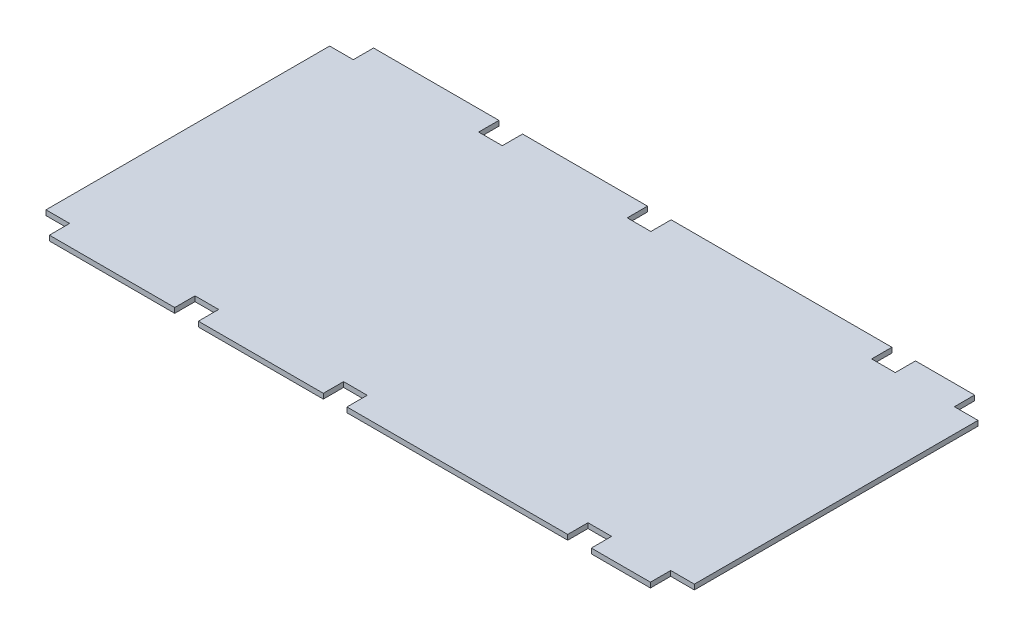
ISO-10303-21;
HEADER;
FILE_DESCRIPTION(('STEP AP214'),'2;1');
FILE_NAME('part.step','',(''),(''),'','','');
FILE_SCHEMA(('AUTOMOTIVE_DESIGN { 1 0 10303 214 1 1 1 1 }'));
ENDSEC;
DATA;
#1=APPLICATION_CONTEXT('core data for automotive mechanical design processes');
#2=APPLICATION_PROTOCOL_DEFINITION('international standard','automotive_design',2000,#1);
#3=PRODUCT_CONTEXT('',#1,'mechanical');
#4=PRODUCT('Part','Part','',(#3));
#5=PRODUCT_RELATED_PRODUCT_CATEGORY('part','',(#4));
#6=PRODUCT_DEFINITION_FORMATION('','',#4);
#7=PRODUCT_DEFINITION_CONTEXT('part definition',#1,'design');
#8=PRODUCT_DEFINITION('design','',#6,#7);
#9=PRODUCT_DEFINITION_SHAPE('','',#8);
#10=(LENGTH_UNIT() NAMED_UNIT(*) SI_UNIT(.MILLI.,.METRE.));
#11=(NAMED_UNIT(*) PLANE_ANGLE_UNIT() SI_UNIT($,.RADIAN.));
#12=(NAMED_UNIT(*) SI_UNIT($,.STERADIAN.) SOLID_ANGLE_UNIT());
#13=UNCERTAINTY_MEASURE_WITH_UNIT(LENGTH_MEASURE(1.E-05),#10,'distance_accuracy_value','');
#14=(GEOMETRIC_REPRESENTATION_CONTEXT(3) GLOBAL_UNCERTAINTY_ASSIGNED_CONTEXT((#13)) GLOBAL_UNIT_ASSIGNED_CONTEXT((#10,
#11,#12)) REPRESENTATION_CONTEXT('',''));
#15=CARTESIAN_POINT('',(0.,0.,0.));
#16=DIRECTION('',(0.,0.,1.));
#17=DIRECTION('',(1.,0.,0.));
#18=AXIS2_PLACEMENT_3D('',#15,#16,#17);
#19=CARTESIAN_POINT('',(0.,9.525,0.));
#20=DIRECTION('',(0.,0.,-1.));
#21=DIRECTION('',(-1.,0.,0.));
#22=AXIS2_PLACEMENT_3D('',#19,#20,#21);
#23=PLANE('',#22);
#24=DIRECTION('',(1.,0.,0.));
#25=VECTOR('',#24,1.);
#26=CARTESIAN_POINT('',(0.,-9.525,0.));
#27=LINE('',#26,#25);
#28=CARTESIAN_POINT('',(1208.0875,-9.525,2.22044604925031E-13));
#29=VERTEX_POINT('',#28);
#30=CARTESIAN_POINT('',(2038.35,-9.525,2.22044604925031E-13));
#31=VERTEX_POINT('',#30);
#32=EDGE_CURVE('E314',#29,#31,#27,.T.);
#33=ORIENTED_EDGE('',*,*,#32,.T.);
#34=DIRECTION('',(0.,1.,0.));
#35=VECTOR('',#34,1.);
#36=CARTESIAN_POINT('',(2038.35,-9.525,2.22044604925031E-13));
#37=LINE('',#36,#35);
#38=CARTESIAN_POINT('',(2038.35,9.525,2.22044604925031E-13));
#39=VERTEX_POINT('',#38);
#40=EDGE_CURVE('E341',#31,#39,#37,.T.);
#41=ORIENTED_EDGE('',*,*,#40,.T.);
#42=DIRECTION('',(1.,0.,0.));
#43=VECTOR('',#42,1.);
#44=CARTESIAN_POINT('',(0.,9.525,0.));
#45=LINE('',#44,#43);
#46=CARTESIAN_POINT('',(1208.0875,9.525,2.22044604925031E-13));
#47=VERTEX_POINT('',#46);
#48=EDGE_CURVE('E401',#47,#39,#45,.T.);
#49=ORIENTED_EDGE('',*,*,#48,.F.);
#50=DIRECTION('',(0.,1.,0.));
#51=VECTOR('',#50,1.);
#52=CARTESIAN_POINT('',(1208.0875,-9.525,2.22044604925031E-13));
#53=LINE('',#52,#51);
#54=EDGE_CURVE('E343',#29,#47,#53,.T.);
#55=ORIENTED_EDGE('',*,*,#54,.F.);
#56=EDGE_LOOP('',(#33,#41,#49,#55));
#57=FACE_BOUND('',#56,.T.);
#58=ADVANCED_FACE('F38',(#57),#23,.F.);
#59=CARTESIAN_POINT('',(88.8999999999995,9.525,-4.44089209850063E-13));
#60=VERTEX_POINT('',#59);
#61=CARTESIAN_POINT('',(560.3875,9.525,0.));
#62=VERTEX_POINT('',#61);
#63=EDGE_CURVE('E305',#60,#62,#45,.T.);
#64=ORIENTED_EDGE('',*,*,#63,.F.);
#65=DIRECTION('',(0.,1.,0.));
#66=VECTOR('',#65,1.);
#67=CARTESIAN_POINT('',(88.8999999999995,-9.525,-4.44089209850063E-13));
#68=LINE('',#67,#66);
#69=CARTESIAN_POINT('',(88.8999999999995,-9.525,-4.44089209850063E-13));
#70=VERTEX_POINT('',#69);
#71=EDGE_CURVE('E367',#70,#60,#68,.T.);
#72=ORIENTED_EDGE('',*,*,#71,.F.);
#73=CARTESIAN_POINT('',(560.3875,-9.525,0.));
#74=VERTEX_POINT('',#73);
#75=EDGE_CURVE('E315',#70,#74,#27,.T.);
#76=ORIENTED_EDGE('',*,*,#75,.T.);
#77=DIRECTION('',(0.,1.,0.));
#78=VECTOR('',#77,1.);
#79=CARTESIAN_POINT('',(560.3875,-9.525,0.));
#80=LINE('',#79,#78);
#81=EDGE_CURVE('E452',#74,#62,#80,.T.);
#82=ORIENTED_EDGE('',*,*,#81,.T.);
#83=EDGE_LOOP('',(#64,#72,#76,#82));
#84=FACE_BOUND('',#83,.T.);
#85=ADVANCED_FACE('F510',(#84),#23,.F.);
#86=CARTESIAN_POINT('',(649.2875,9.525,0.));
#87=VERTEX_POINT('',#86);
#88=CARTESIAN_POINT('',(1119.1875,9.525,0.));
#89=VERTEX_POINT('',#88);
#90=EDGE_CURVE('E405',#87,#89,#45,.T.);
#91=ORIENTED_EDGE('',*,*,#90,.F.);
#92=DIRECTION('',(0.,1.,0.));
#93=VECTOR('',#92,1.);
#94=CARTESIAN_POINT('',(649.2875,-9.525,0.));
#95=LINE('',#94,#93);
#96=CARTESIAN_POINT('',(649.2875,-9.525,0.));
#97=VERTEX_POINT('',#96);
#98=EDGE_CURVE('E420',#97,#87,#95,.T.);
#99=ORIENTED_EDGE('',*,*,#98,.F.);
#100=CARTESIAN_POINT('',(1119.1875,-9.525,0.));
#101=VERTEX_POINT('',#100);
#102=EDGE_CURVE('E325',#97,#101,#27,.T.);
#103=ORIENTED_EDGE('',*,*,#102,.T.);
#104=DIRECTION('',(0.,1.,0.));
#105=VECTOR('',#104,1.);
#106=CARTESIAN_POINT('',(1119.1875,-9.525,0.));
#107=LINE('',#106,#105);
#108=EDGE_CURVE('E421',#101,#89,#107,.T.);
#109=ORIENTED_EDGE('',*,*,#108,.T.);
#110=EDGE_LOOP('',(#91,#99,#103,#109));
#111=FACE_BOUND('',#110,.T.);
#112=ADVANCED_FACE('F419',(#111),#23,.F.);
#113=CARTESIAN_POINT('',(-2.29534139493609E-13,9.525,-1219.2));
#114=DIRECTION('',(0.,0.,1.));
#115=DIRECTION('',(1.,0.,0.));
#116=AXIS2_PLACEMENT_3D('',#113,#114,#115);
#117=PLANE('',#116);
#118=DIRECTION('',(-1.,0.,0.));
#119=VECTOR('',#118,1.);
#120=CARTESIAN_POINT('',(-2.29534139493609E-13,9.525,-1219.2));
#121=LINE('',#120,#119);
#122=CARTESIAN_POINT('',(2038.35,9.525,-1219.2));
#123=VERTEX_POINT('',#122);
#124=CARTESIAN_POINT('',(1208.0875,9.525,-1219.2));
#125=VERTEX_POINT('',#124);
#126=EDGE_CURVE('E47',#123,#125,#121,.T.);
#127=ORIENTED_EDGE('',*,*,#126,.F.);
#128=DIRECTION('',(0.,1.,0.));
#129=VECTOR('',#128,1.);
#130=CARTESIAN_POINT('',(2038.35,-9.525,-1219.2));
#131=LINE('',#130,#129);
#132=CARTESIAN_POINT('',(2038.35,-9.525,-1219.2));
#133=VERTEX_POINT('',#132);
#134=EDGE_CURVE('E870',#133,#123,#131,.T.);
#135=ORIENTED_EDGE('',*,*,#134,.F.);
#136=DIRECTION('',(-1.,0.,0.));
#137=VECTOR('',#136,1.);
#138=CARTESIAN_POINT('',(-2.29534139493609E-13,-9.525,-1219.2));
#139=LINE('',#138,#137);
#140=CARTESIAN_POINT('',(1208.0875,-9.525,-1219.2));
#141=VERTEX_POINT('',#140);
#142=EDGE_CURVE('E947',#133,#141,#139,.T.);
#143=ORIENTED_EDGE('',*,*,#142,.T.);
#144=DIRECTION('',(0.,1.,0.));
#145=VECTOR('',#144,1.);
#146=CARTESIAN_POINT('',(1208.0875,-9.525,-1219.2));
#147=LINE('',#146,#145);
#148=EDGE_CURVE('E912',#141,#125,#147,.T.);
#149=ORIENTED_EDGE('',*,*,#148,.T.);
#150=EDGE_LOOP('',(#127,#135,#143,#149));
#151=FACE_BOUND('',#150,.T.);
#152=ADVANCED_FACE('F526',(#151),#117,.F.);
#153=CARTESIAN_POINT('',(2349.5,9.525,-1219.2));
#154=VERTEX_POINT('',#153);
#155=CARTESIAN_POINT('',(2127.25,9.525,-1219.2));
#156=VERTEX_POINT('',#155);
#157=EDGE_CURVE('E11',#154,#156,#121,.T.);
#158=ORIENTED_EDGE('',*,*,#157,.F.);
#159=DIRECTION('',(0.,1.,0.));
#160=VECTOR('',#159,1.);
#161=CARTESIAN_POINT('',(2349.5,-9.525,-1219.2));
#162=LINE('',#161,#160);
#163=CARTESIAN_POINT('',(2349.5,-9.525,-1219.2));
#164=VERTEX_POINT('',#163);
#165=EDGE_CURVE('E440',#164,#154,#162,.T.);
#166=ORIENTED_EDGE('',*,*,#165,.F.);
#167=CARTESIAN_POINT('',(2127.25,-9.525,-1219.2));
#168=VERTEX_POINT('',#167);
#169=EDGE_CURVE('E323',#164,#168,#139,.T.);
#170=ORIENTED_EDGE('',*,*,#169,.T.);
#171=DIRECTION('',(0.,1.,0.));
#172=VECTOR('',#171,1.);
#173=CARTESIAN_POINT('',(2127.25,-9.525,-1219.2));
#174=LINE('',#173,#172);
#175=EDGE_CURVE('E896',#168,#156,#174,.T.);
#176=ORIENTED_EDGE('',*,*,#175,.T.);
#177=EDGE_LOOP('',(#158,#166,#170,#176));
#178=FACE_BOUND('',#177,.T.);
#179=ADVANCED_FACE('F530',(#178),#117,.F.);
#180=CARTESIAN_POINT('',(560.3875,9.525,-1219.2));
#181=VERTEX_POINT('',#180);
#182=CARTESIAN_POINT('',(88.8999999999997,9.525,-1219.2));
#183=VERTEX_POINT('',#182);
#184=EDGE_CURVE('E49',#181,#183,#121,.T.);
#185=ORIENTED_EDGE('',*,*,#184,.F.);
#186=DIRECTION('',(0.,1.,0.));
#187=VECTOR('',#186,1.);
#188=CARTESIAN_POINT('',(560.3875,-9.525,-1219.2));
#189=LINE('',#188,#187);
#190=CARTESIAN_POINT('',(560.3875,-9.525,-1219.2));
#191=VERTEX_POINT('',#190);
#192=EDGE_CURVE('E274',#191,#181,#189,.T.);
#193=ORIENTED_EDGE('',*,*,#192,.F.);
#194=CARTESIAN_POINT('',(88.8999999999997,-9.525,-1219.2));
#195=VERTEX_POINT('',#194);
#196=EDGE_CURVE('E42',#191,#195,#139,.T.);
#197=ORIENTED_EDGE('',*,*,#196,.T.);
#198=DIRECTION('',(0.,1.,0.));
#199=VECTOR('',#198,1.);
#200=CARTESIAN_POINT('',(88.8999999999997,-9.525,-1219.2));
#201=LINE('',#200,#199);
#202=EDGE_CURVE('E300',#195,#183,#201,.T.);
#203=ORIENTED_EDGE('',*,*,#202,.T.);
#204=EDGE_LOOP('',(#185,#193,#197,#203));
#205=FACE_BOUND('',#204,.T.);
#206=ADVANCED_FACE('F299',(#205),#117,.F.);
#207=CARTESIAN_POINT('',(-2.29534139493609E-13,9.525,-1219.2));
#208=DIRECTION('',(1.,0.,0.));
#209=DIRECTION('',(0.,0.,-1.));
#210=AXIS2_PLACEMENT_3D('',#207,#208,#209);
#211=PLANE('',#210);
#212=DIRECTION('',(0.,0.,1.));
#213=VECTOR('',#212,1.);
#214=CARTESIAN_POINT('',(-2.29534139493609E-13,-9.525,-1219.2));
#215=LINE('',#214,#213);
#216=CARTESIAN_POINT('',(0.,-9.525,-1143.));
#217=VERTEX_POINT('',#216);
#218=CARTESIAN_POINT('',(0.,-9.525,-76.2));
#219=VERTEX_POINT('',#218);
#220=EDGE_CURVE('E309',#217,#219,#215,.T.);
#221=ORIENTED_EDGE('',*,*,#220,.T.);
#222=DIRECTION('',(0.,1.,0.));
#223=VECTOR('',#222,1.);
#224=CARTESIAN_POINT('',(0.,-9.525,-76.2));
#225=LINE('',#224,#223);
#226=CARTESIAN_POINT('',(0.,9.525,-76.2));
#227=VERTEX_POINT('',#226);
#228=EDGE_CURVE('E371',#219,#227,#225,.T.);
#229=ORIENTED_EDGE('',*,*,#228,.T.);
#230=DIRECTION('',(0.,0.,1.));
#231=VECTOR('',#230,1.);
#232=CARTESIAN_POINT('',(-2.29534139493609E-13,9.525,-1219.2));
#233=LINE('',#232,#231);
#234=CARTESIAN_POINT('',(0.,9.525,-1143.));
#235=VERTEX_POINT('',#234);
#236=EDGE_CURVE('E397',#235,#227,#233,.T.);
#237=ORIENTED_EDGE('',*,*,#236,.F.);
#238=DIRECTION('',(0.,1.,0.));
#239=VECTOR('',#238,1.);
#240=CARTESIAN_POINT('',(0.,-9.525,-1143.));
#241=LINE('',#240,#239);
#242=EDGE_CURVE('E389',#217,#235,#241,.T.);
#243=ORIENTED_EDGE('',*,*,#242,.F.);
#244=EDGE_LOOP('',(#221,#229,#237,#243));
#245=FACE_BOUND('',#244,.T.);
#246=ADVANCED_FACE('F40',(#245),#211,.F.);
#247=CARTESIAN_POINT('',(2127.25,9.525,2.22044604925031E-13));
#248=VERTEX_POINT('',#247);
#249=CARTESIAN_POINT('',(2349.5,9.525,6.66133814775094E-13));
#250=VERTEX_POINT('',#249);
#251=EDGE_CURVE('E399',#248,#250,#45,.T.);
#252=ORIENTED_EDGE('',*,*,#251,.F.);
#253=DIRECTION('',(0.,1.,0.));
#254=VECTOR('',#253,1.);
#255=CARTESIAN_POINT('',(2127.25,-9.525,2.22044604925031E-13));
#256=LINE('',#255,#254);
#257=CARTESIAN_POINT('',(2127.25,-9.525,2.22044604925031E-13));
#258=VERTEX_POINT('',#257);
#259=EDGE_CURVE('E355',#258,#248,#256,.T.);
#260=ORIENTED_EDGE('',*,*,#259,.F.);
#261=CARTESIAN_POINT('',(2349.5,-9.525,6.66133814775094E-13));
#262=VERTEX_POINT('',#261);
#263=EDGE_CURVE('E312',#258,#262,#27,.T.);
#264=ORIENTED_EDGE('',*,*,#263,.T.);
#265=DIRECTION('',(0.,1.,0.));
#266=VECTOR('',#265,1.);
#267=CARTESIAN_POINT('',(2349.5,-9.525,6.66133814775094E-13));
#268=LINE('',#267,#266);
#269=EDGE_CURVE('E472',#262,#250,#268,.T.);
#270=ORIENTED_EDGE('',*,*,#269,.T.);
#271=EDGE_LOOP('',(#252,#260,#264,#270));
#272=FACE_BOUND('',#271,.T.);
#273=ADVANCED_FACE('F511',(#272),#23,.F.);
#274=CARTESIAN_POINT('',(2438.4,9.525,-1219.2));
#275=DIRECTION('',(-1.,0.,0.));
#276=DIRECTION('',(0.,0.,1.));
#277=AXIS2_PLACEMENT_3D('',#274,#275,#276);
#278=PLANE('',#277);
#279=DIRECTION('',(0.,0.,-1.));
#280=VECTOR('',#279,1.);
#281=CARTESIAN_POINT('',(2438.4,9.525,-1219.2));
#282=LINE('',#281,#280);
#283=CARTESIAN_POINT('',(2438.4,9.525,-76.2));
#284=VERTEX_POINT('',#283);
#285=CARTESIAN_POINT('',(2438.4,9.525,-1143.));
#286=VERTEX_POINT('',#285);
#287=EDGE_CURVE('E302',#284,#286,#282,.T.);
#288=ORIENTED_EDGE('',*,*,#287,.F.);
#289=DIRECTION('',(0.,1.,0.));
#290=VECTOR('',#289,1.);
#291=CARTESIAN_POINT('',(2438.4,-9.525,-76.2));
#292=LINE('',#291,#290);
#293=CARTESIAN_POINT('',(2438.4,-9.525,-76.2));
#294=VERTEX_POINT('',#293);
#295=EDGE_CURVE('E467',#294,#284,#292,.T.);
#296=ORIENTED_EDGE('',*,*,#295,.F.);
#297=DIRECTION('',(0.,0.,-1.));
#298=VECTOR('',#297,1.);
#299=CARTESIAN_POINT('',(2438.4,-9.525,-1219.2));
#300=LINE('',#299,#298);
#301=CARTESIAN_POINT('',(2438.4,-9.525,-1143.));
#302=VERTEX_POINT('',#301);
#303=EDGE_CURVE('E316',#294,#302,#300,.T.);
#304=ORIENTED_EDGE('',*,*,#303,.T.);
#305=DIRECTION('',(0.,1.,0.));
#306=VECTOR('',#305,1.);
#307=CARTESIAN_POINT('',(2438.4,-9.525,-1143.));
#308=LINE('',#307,#306);
#309=EDGE_CURVE('E873',#302,#286,#308,.T.);
#310=ORIENTED_EDGE('',*,*,#309,.T.);
#311=EDGE_LOOP('',(#288,#296,#304,#310));
#312=FACE_BOUND('',#311,.T.);
#313=ADVANCED_FACE('F517',(#312),#278,.F.);
#314=CARTESIAN_POINT('',(1119.1875,9.525,-1219.2));
#315=VERTEX_POINT('',#314);
#316=CARTESIAN_POINT('',(649.2875,9.525,-1219.2));
#317=VERTEX_POINT('',#316);
#318=EDGE_CURVE('E301',#315,#317,#121,.T.);
#319=ORIENTED_EDGE('',*,*,#318,.F.);
#320=DIRECTION('',(0.,1.,0.));
#321=VECTOR('',#320,1.);
#322=CARTESIAN_POINT('',(1119.1875,-9.525,-1219.2));
#323=LINE('',#322,#321);
#324=CARTESIAN_POINT('',(1119.1875,-9.525,-1219.2));
#325=VERTEX_POINT('',#324);
#326=EDGE_CURVE('E922',#325,#315,#323,.T.);
#327=ORIENTED_EDGE('',*,*,#326,.F.);
#328=CARTESIAN_POINT('',(649.2875,-9.525,-1219.2));
#329=VERTEX_POINT('',#328);
#330=EDGE_CURVE('E322',#325,#329,#139,.T.);
#331=ORIENTED_EDGE('',*,*,#330,.T.);
#332=DIRECTION('',(0.,1.,0.));
#333=VECTOR('',#332,1.);
#334=CARTESIAN_POINT('',(649.2875,-9.525,-1219.2));
#335=LINE('',#334,#333);
#336=EDGE_CURVE('E285',#329,#317,#335,.T.);
#337=ORIENTED_EDGE('',*,*,#336,.T.);
#338=EDGE_LOOP('',(#319,#327,#331,#337));
#339=FACE_BOUND('',#338,.T.);
#340=ADVANCED_FACE('F523',(#339),#117,.F.);
#341=CARTESIAN_POINT('',(0.,9.525,0.));
#342=DIRECTION('',(0.,1.,0.));
#343=DIRECTION('',(0.,0.,1.));
#344=AXIS2_PLACEMENT_3D('',#341,#342,#343);
#345=PLANE('',#344);
#346=DIRECTION('',(-1.,0.,0.));
#347=VECTOR('',#346,1.);
#348=CARTESIAN_POINT('',(0.,9.525,-76.2));
#349=LINE('',#348,#347);
#350=CARTESIAN_POINT('',(88.8999999999998,9.525,-76.2));
#351=VERTEX_POINT('',#350);
#352=EDGE_CURVE('E374',#351,#227,#349,.T.);
#353=ORIENTED_EDGE('',*,*,#352,.F.);
#354=DIRECTION('',(0.,0.,-1.));
#355=VECTOR('',#354,1.);
#356=CARTESIAN_POINT('',(88.8999999999995,9.525,-4.44089209850063E-13));
#357=LINE('',#356,#355);
#358=EDGE_CURVE('E376',#60,#351,#357,.T.);
#359=ORIENTED_EDGE('',*,*,#358,.F.);
#360=ORIENTED_EDGE('',*,*,#63,.T.);
#361=DIRECTION('',(0.,0.,1.));
#362=VECTOR('',#361,1.);
#363=CARTESIAN_POINT('',(560.3875,9.525,0.));
#364=LINE('',#363,#362);
#365=CARTESIAN_POINT('',(560.3875,9.525,-76.2));
#366=VERTEX_POINT('',#365);
#367=EDGE_CURVE('E455',#366,#62,#364,.T.);
#368=ORIENTED_EDGE('',*,*,#367,.F.);
#369=DIRECTION('',(-1.,0.,0.));
#370=VECTOR('',#369,1.);
#371=CARTESIAN_POINT('',(560.3875,9.525,-76.2));
#372=LINE('',#371,#370);
#373=CARTESIAN_POINT('',(649.2875,9.525,-76.2));
#374=VERTEX_POINT('',#373);
#375=EDGE_CURVE('E429',#374,#366,#372,.T.);
#376=ORIENTED_EDGE('',*,*,#375,.F.);
#377=DIRECTION('',(0.,0.,-1.));
#378=VECTOR('',#377,1.);
#379=CARTESIAN_POINT('',(649.2875,9.525,0.));
#380=LINE('',#379,#378);
#381=EDGE_CURVE('E418',#87,#374,#380,.T.);
#382=ORIENTED_EDGE('',*,*,#381,.F.);
#383=ORIENTED_EDGE('',*,*,#90,.T.);
#384=DIRECTION('',(0.,0.,1.));
#385=VECTOR('',#384,1.);
#386=CARTESIAN_POINT('',(1119.1875,9.525,0.));
#387=LINE('',#386,#385);
#388=CARTESIAN_POINT('',(1119.1875,9.525,-76.2));
#389=VERTEX_POINT('',#388);
#390=EDGE_CURVE('E415',#389,#89,#387,.T.);
#391=ORIENTED_EDGE('',*,*,#390,.F.);
#392=DIRECTION('',(-1.,0.,0.));
#393=VECTOR('',#392,1.);
#394=CARTESIAN_POINT('',(1119.1875,9.525,-76.2));
#395=LINE('',#394,#393);
#396=CARTESIAN_POINT('',(1208.0875,9.525,-76.1999999999998));
#397=VERTEX_POINT('',#396);
#398=EDGE_CURVE('E434',#397,#389,#395,.T.);
#399=ORIENTED_EDGE('',*,*,#398,.F.);
#400=DIRECTION('',(0.,0.,-1.));
#401=VECTOR('',#400,1.);
#402=CARTESIAN_POINT('',(1208.0875,9.525,2.22044604925031E-13));
#403=LINE('',#402,#401);
#404=EDGE_CURVE('E437',#47,#397,#403,.T.);
#405=ORIENTED_EDGE('',*,*,#404,.F.);
#406=ORIENTED_EDGE('',*,*,#48,.T.);
#407=DIRECTION('',(0.,0.,1.));
#408=VECTOR('',#407,1.);
#409=CARTESIAN_POINT('',(2038.35,9.525,2.22044604925031E-13));
#410=LINE('',#409,#408);
#411=CARTESIAN_POINT('',(2038.35,9.525,-76.2));
#412=VERTEX_POINT('',#411);
#413=EDGE_CURVE('E366',#412,#39,#410,.T.);
#414=ORIENTED_EDGE('',*,*,#413,.F.);
#415=DIRECTION('',(-1.,0.,0.));
#416=VECTOR('',#415,1.);
#417=CARTESIAN_POINT('',(2038.35,9.525,-76.2));
#418=LINE('',#417,#416);
#419=CARTESIAN_POINT('',(2127.25,9.525,-76.2));
#420=VERTEX_POINT('',#419);
#421=EDGE_CURVE('E488',#420,#412,#418,.T.);
#422=ORIENTED_EDGE('',*,*,#421,.F.);
#423=DIRECTION('',(0.,0.,-1.));
#424=VECTOR('',#423,1.);
#425=CARTESIAN_POINT('',(2127.25,9.525,2.22044604925031E-13));
#426=LINE('',#425,#424);
#427=EDGE_CURVE('E362',#248,#420,#426,.T.);
#428=ORIENTED_EDGE('',*,*,#427,.F.);
#429=ORIENTED_EDGE('',*,*,#251,.T.);
#430=DIRECTION('',(0.,0.,1.));
#431=VECTOR('',#430,1.);
#432=CARTESIAN_POINT('',(2349.5,9.525,6.66133814775094E-13));
#433=LINE('',#432,#431);
#434=CARTESIAN_POINT('',(2349.5,9.525,-76.2));
#435=VERTEX_POINT('',#434);
#436=EDGE_CURVE('E475',#435,#250,#433,.T.);
#437=ORIENTED_EDGE('',*,*,#436,.F.);
#438=DIRECTION('',(-1.,0.,0.));
#439=VECTOR('',#438,1.);
#440=CARTESIAN_POINT('',(2349.5,9.525,-76.2));
#441=LINE('',#440,#439);
#442=EDGE_CURVE('E454',#284,#435,#441,.T.);
#443=ORIENTED_EDGE('',*,*,#442,.F.);
#444=ORIENTED_EDGE('',*,*,#287,.T.);
#445=DIRECTION('',(1.,0.,0.));
#446=VECTOR('',#445,1.);
#447=CARTESIAN_POINT('',(2349.5,9.525,-1143.));
#448=LINE('',#447,#446);
#449=CARTESIAN_POINT('',(2349.5,9.525,-1143.));
#450=VERTEX_POINT('',#449);
#451=EDGE_CURVE('E862',#450,#286,#448,.T.);
#452=ORIENTED_EDGE('',*,*,#451,.F.);
#453=DIRECTION('',(0.,0.,1.));
#454=VECTOR('',#453,1.);
#455=CARTESIAN_POINT('',(2349.5,9.525,-1219.2));
#456=LINE('',#455,#454);
#457=EDGE_CURVE('E867',#154,#450,#456,.T.);
#458=ORIENTED_EDGE('',*,*,#457,.F.);
#459=ORIENTED_EDGE('',*,*,#157,.T.);
#460=DIRECTION('',(0.,0.,-1.));
#461=VECTOR('',#460,1.);
#462=CARTESIAN_POINT('',(2127.25,9.525,-1219.2));
#463=LINE('',#462,#461);
#464=CARTESIAN_POINT('',(2127.25,9.525,-1143.));
#465=VERTEX_POINT('',#464);
#466=EDGE_CURVE('E879',#465,#156,#463,.T.);
#467=ORIENTED_EDGE('',*,*,#466,.F.);
#468=DIRECTION('',(1.,0.,0.));
#469=VECTOR('',#468,1.);
#470=CARTESIAN_POINT('',(2038.35,9.525,-1143.));
#471=LINE('',#470,#469);
#472=CARTESIAN_POINT('',(2038.35,9.525,-1143.));
#473=VERTEX_POINT('',#472);
#474=EDGE_CURVE('E891',#473,#465,#471,.T.);
#475=ORIENTED_EDGE('',*,*,#474,.F.);
#476=DIRECTION('',(0.,0.,1.));
#477=VECTOR('',#476,1.);
#478=CARTESIAN_POINT('',(2038.35,9.525,-1219.2));
#479=LINE('',#478,#477);
#480=EDGE_CURVE('E887',#123,#473,#479,.T.);
#481=ORIENTED_EDGE('',*,*,#480,.F.);
#482=ORIENTED_EDGE('',*,*,#126,.T.);
#483=DIRECTION('',(0.,0.,-1.));
#484=VECTOR('',#483,1.);
#485=CARTESIAN_POINT('',(1208.0875,9.525,-1219.2));
#486=LINE('',#485,#484);
#487=CARTESIAN_POINT('',(1208.0875,9.525,-1143.));
#488=VERTEX_POINT('',#487);
#489=EDGE_CURVE('E286',#488,#125,#486,.T.);
#490=ORIENTED_EDGE('',*,*,#489,.F.);
#491=DIRECTION('',(1.,0.,0.));
#492=VECTOR('',#491,1.);
#493=CARTESIAN_POINT('',(1119.1875,9.525,-1143.));
#494=LINE('',#493,#492);
#495=CARTESIAN_POINT('',(1119.1875,9.525,-1143.));
#496=VERTEX_POINT('',#495);
#497=EDGE_CURVE('E905',#496,#488,#494,.T.);
#498=ORIENTED_EDGE('',*,*,#497,.F.);
#499=DIRECTION('',(0.,0.,1.));
#500=VECTOR('',#499,1.);
#501=CARTESIAN_POINT('',(1119.1875,9.525,-1219.2));
#502=LINE('',#501,#500);
#503=EDGE_CURVE('E914',#315,#496,#502,.T.);
#504=ORIENTED_EDGE('',*,*,#503,.F.);
#505=ORIENTED_EDGE('',*,*,#318,.T.);
#506=DIRECTION('',(0.,0.,-1.));
#507=VECTOR('',#506,1.);
#508=CARTESIAN_POINT('',(649.2875,9.525,-1219.2));
#509=LINE('',#508,#507);
#510=CARTESIAN_POINT('',(649.2875,9.525,-1143.));
#511=VERTEX_POINT('',#510);
#512=EDGE_CURVE('E927',#511,#317,#509,.T.);
#513=ORIENTED_EDGE('',*,*,#512,.F.);
#514=DIRECTION('',(1.,0.,0.));
#515=VECTOR('',#514,1.);
#516=CARTESIAN_POINT('',(560.3875,9.525,-1143.));
#517=LINE('',#516,#515);
#518=CARTESIAN_POINT('',(560.3875,9.525,-1143.));
#519=VERTEX_POINT('',#518);
#520=EDGE_CURVE('E295',#519,#511,#517,.T.);
#521=ORIENTED_EDGE('',*,*,#520,.F.);
#522=DIRECTION('',(0.,0.,1.));
#523=VECTOR('',#522,1.);
#524=CARTESIAN_POINT('',(560.3875,9.525,-1219.2));
#525=LINE('',#524,#523);
#526=EDGE_CURVE('E277',#181,#519,#525,.T.);
#527=ORIENTED_EDGE('',*,*,#526,.F.);
#528=ORIENTED_EDGE('',*,*,#184,.T.);
#529=DIRECTION('',(0.,0.,-1.));
#530=VECTOR('',#529,1.);
#531=CARTESIAN_POINT('',(88.8999999999997,9.525,-1219.2));
#532=LINE('',#531,#530);
#533=CARTESIAN_POINT('',(88.8999999999998,9.525,-1143.));
#534=VERTEX_POINT('',#533);
#535=EDGE_CURVE('E386',#534,#183,#532,.T.);
#536=ORIENTED_EDGE('',*,*,#535,.F.);
#537=DIRECTION('',(1.,0.,0.));
#538=VECTOR('',#537,1.);
#539=CARTESIAN_POINT('',(0.,9.525,-1143.));
#540=LINE('',#539,#538);
#541=EDGE_CURVE('E296',#235,#534,#540,.T.);
#542=ORIENTED_EDGE('',*,*,#541,.F.);
#543=ORIENTED_EDGE('',*,*,#236,.T.);
#544=EDGE_LOOP('',(#353,#359,#360,#368,#376,#382,#383,#391,#399,#405,#406,#414,#422,#428,#429,
#437,#443,#444,#452,#458,#459,#467,#475,#481,#482,#490,#498,#504,#505,#513,#521,#527,#528,#536,
#542,#543));
#545=FACE_BOUND('',#544,.T.);
#546=ADVANCED_FACE('F291',(#545),#345,.T.);
#547=CARTESIAN_POINT('',(0.,-9.525,0.));
#548=DIRECTION('',(0.,1.,0.));
#549=DIRECTION('',(0.,0.,1.));
#550=AXIS2_PLACEMENT_3D('',#547,#548,#549);
#551=PLANE('',#550);
#552=DIRECTION('',(0.,0.,-1.));
#553=VECTOR('',#552,1.);
#554=CARTESIAN_POINT('',(88.8999999999995,-9.525,-4.44089209850063E-13));
#555=LINE('',#554,#553);
#556=CARTESIAN_POINT('',(88.8999999999998,-9.525,-76.2));
#557=VERTEX_POINT('',#556);
#558=EDGE_CURVE('E377',#70,#557,#555,.T.);
#559=ORIENTED_EDGE('',*,*,#558,.T.);
#560=DIRECTION('',(-1.,0.,0.));
#561=VECTOR('',#560,1.);
#562=CARTESIAN_POINT('',(0.,-9.525,-76.2));
#563=LINE('',#562,#561);
#564=EDGE_CURVE('E56',#557,#219,#563,.T.);
#565=ORIENTED_EDGE('',*,*,#564,.T.);
#566=ORIENTED_EDGE('',*,*,#220,.F.);
#567=DIRECTION('',(1.,0.,0.));
#568=VECTOR('',#567,1.);
#569=CARTESIAN_POINT('',(0.,-9.525,-1143.));
#570=LINE('',#569,#568);
#571=CARTESIAN_POINT('',(88.8999999999998,-9.525,-1143.));
#572=VERTEX_POINT('',#571);
#573=EDGE_CURVE('E382',#217,#572,#570,.T.);
#574=ORIENTED_EDGE('',*,*,#573,.T.);
#575=DIRECTION('',(0.,0.,-1.));
#576=VECTOR('',#575,1.);
#577=CARTESIAN_POINT('',(88.8999999999997,-9.525,-1219.2));
#578=LINE('',#577,#576);
#579=EDGE_CURVE('E385',#572,#195,#578,.T.);
#580=ORIENTED_EDGE('',*,*,#579,.T.);
#581=ORIENTED_EDGE('',*,*,#196,.F.);
#582=DIRECTION('',(0.,0.,1.));
#583=VECTOR('',#582,1.);
#584=CARTESIAN_POINT('',(560.3875,-9.525,-1219.2));
#585=LINE('',#584,#583);
#586=CARTESIAN_POINT('',(560.3875,-9.525,-1143.));
#587=VERTEX_POINT('',#586);
#588=EDGE_CURVE('E280',#191,#587,#585,.T.);
#589=ORIENTED_EDGE('',*,*,#588,.T.);
#590=DIRECTION('',(1.,0.,0.));
#591=VECTOR('',#590,1.);
#592=CARTESIAN_POINT('',(560.3875,-9.525,-1143.));
#593=LINE('',#592,#591);
#594=CARTESIAN_POINT('',(649.2875,-9.525,-1143.));
#595=VERTEX_POINT('',#594);
#596=EDGE_CURVE('E928',#587,#595,#593,.T.);
#597=ORIENTED_EDGE('',*,*,#596,.T.);
#598=DIRECTION('',(0.,0.,-1.));
#599=VECTOR('',#598,1.);
#600=CARTESIAN_POINT('',(649.2875,-9.525,-1219.2));
#601=LINE('',#600,#599);
#602=EDGE_CURVE('E931',#595,#329,#601,.T.);
#603=ORIENTED_EDGE('',*,*,#602,.T.);
#604=ORIENTED_EDGE('',*,*,#330,.F.);
#605=DIRECTION('',(0.,0.,1.));
#606=VECTOR('',#605,1.);
#607=CARTESIAN_POINT('',(1119.1875,-9.525,-1219.2));
#608=LINE('',#607,#606);
#609=CARTESIAN_POINT('',(1119.1875,-9.525,-1143.));
#610=VERTEX_POINT('',#609);
#611=EDGE_CURVE('E906',#325,#610,#608,.T.);
#612=ORIENTED_EDGE('',*,*,#611,.T.);
#613=DIRECTION('',(1.,0.,0.));
#614=VECTOR('',#613,1.);
#615=CARTESIAN_POINT('',(1119.1875,-9.525,-1143.));
#616=LINE('',#615,#614);
#617=CARTESIAN_POINT('',(1208.0875,-9.525,-1143.));
#618=VERTEX_POINT('',#617);
#619=EDGE_CURVE('E909',#610,#618,#616,.T.);
#620=ORIENTED_EDGE('',*,*,#619,.T.);
#621=DIRECTION('',(0.,0.,-1.));
#622=VECTOR('',#621,1.);
#623=CARTESIAN_POINT('',(1208.0875,-9.525,-1219.2));
#624=LINE('',#623,#622);
#625=EDGE_CURVE('E902',#618,#141,#624,.T.);
#626=ORIENTED_EDGE('',*,*,#625,.T.);
#627=ORIENTED_EDGE('',*,*,#142,.F.);
#628=DIRECTION('',(0.,0.,1.));
#629=VECTOR('',#628,1.);
#630=CARTESIAN_POINT('',(2038.35,-9.525,-1219.2));
#631=LINE('',#630,#629);
#632=CARTESIAN_POINT('',(2038.35,-9.525,-1143.));
#633=VERTEX_POINT('',#632);
#634=EDGE_CURVE('E876',#133,#633,#631,.T.);
#635=ORIENTED_EDGE('',*,*,#634,.T.);
#636=DIRECTION('',(1.,0.,0.));
#637=VECTOR('',#636,1.);
#638=CARTESIAN_POINT('',(2038.35,-9.525,-1143.));
#639=LINE('',#638,#637);
#640=CARTESIAN_POINT('',(2127.25,-9.525,-1143.));
#641=VERTEX_POINT('',#640);
#642=EDGE_CURVE('E880',#633,#641,#639,.T.);
#643=ORIENTED_EDGE('',*,*,#642,.T.);
#644=DIRECTION('',(0.,0.,-1.));
#645=VECTOR('',#644,1.);
#646=CARTESIAN_POINT('',(2127.25,-9.525,-1219.2));
#647=LINE('',#646,#645);
#648=EDGE_CURVE('E883',#641,#168,#647,.T.);
#649=ORIENTED_EDGE('',*,*,#648,.T.);
#650=ORIENTED_EDGE('',*,*,#169,.F.);
#651=DIRECTION('',(0.,0.,1.));
#652=VECTOR('',#651,1.);
#653=CARTESIAN_POINT('',(2349.5,-9.525,-1219.2));
#654=LINE('',#653,#652);
#655=CARTESIAN_POINT('',(2349.5,-9.525,-1143.));
#656=VERTEX_POINT('',#655);
#657=EDGE_CURVE('E859',#164,#656,#654,.T.);
#658=ORIENTED_EDGE('',*,*,#657,.T.);
#659=DIRECTION('',(1.,0.,0.));
#660=VECTOR('',#659,1.);
#661=CARTESIAN_POINT('',(2349.5,-9.525,-1143.));
#662=LINE('',#661,#660);
#663=EDGE_CURVE('E863',#656,#302,#662,.T.);
#664=ORIENTED_EDGE('',*,*,#663,.T.);
#665=ORIENTED_EDGE('',*,*,#303,.F.);
#666=DIRECTION('',(-1.,0.,0.));
#667=VECTOR('',#666,1.);
#668=CARTESIAN_POINT('',(2349.5,-9.525,-76.2));
#669=LINE('',#668,#667);
#670=CARTESIAN_POINT('',(2349.5,-9.525,-76.2));
#671=VERTEX_POINT('',#670);
#672=EDGE_CURVE('E477',#294,#671,#669,.T.);
#673=ORIENTED_EDGE('',*,*,#672,.T.);
#674=DIRECTION('',(0.,0.,1.));
#675=VECTOR('',#674,1.);
#676=CARTESIAN_POINT('',(2349.5,-9.525,6.66133814775094E-13));
#677=LINE('',#676,#675);
#678=EDGE_CURVE('E469',#671,#262,#677,.T.);
#679=ORIENTED_EDGE('',*,*,#678,.T.);
#680=ORIENTED_EDGE('',*,*,#263,.F.);
#681=DIRECTION('',(0.,0.,-1.));
#682=VECTOR('',#681,1.);
#683=CARTESIAN_POINT('',(2127.25,-9.525,2.22044604925031E-13));
#684=LINE('',#683,#682);
#685=CARTESIAN_POINT('',(2127.25,-9.525,-76.2));
#686=VERTEX_POINT('',#685);
#687=EDGE_CURVE('E357',#258,#686,#684,.T.);
#688=ORIENTED_EDGE('',*,*,#687,.T.);
#689=DIRECTION('',(-1.,0.,0.));
#690=VECTOR('',#689,1.);
#691=CARTESIAN_POINT('',(2038.35,-9.525,-76.2));
#692=LINE('',#691,#690);
#693=CARTESIAN_POINT('',(2038.35,-9.525,-76.2));
#694=VERTEX_POINT('',#693);
#695=EDGE_CURVE('E64',#686,#694,#692,.T.);
#696=ORIENTED_EDGE('',*,*,#695,.T.);
#697=DIRECTION('',(0.,0.,1.));
#698=VECTOR('',#697,1.);
#699=CARTESIAN_POINT('',(2038.35,-9.525,2.22044604925031E-13));
#700=LINE('',#699,#698);
#701=EDGE_CURVE('E352',#694,#31,#700,.T.);
#702=ORIENTED_EDGE('',*,*,#701,.T.);
#703=ORIENTED_EDGE('',*,*,#32,.F.);
#704=DIRECTION('',(0.,0.,-1.));
#705=VECTOR('',#704,1.);
#706=CARTESIAN_POINT('',(1208.0875,-9.525,2.22044604925031E-13));
#707=LINE('',#706,#705);
#708=CARTESIAN_POINT('',(1208.0875,-9.525,-76.1999999999998));
#709=VERTEX_POINT('',#708);
#710=EDGE_CURVE('E350',#29,#709,#707,.T.);
#711=ORIENTED_EDGE('',*,*,#710,.T.);
#712=DIRECTION('',(-1.,0.,0.));
#713=VECTOR('',#712,1.);
#714=CARTESIAN_POINT('',(1119.1875,-9.525,-76.2));
#715=LINE('',#714,#713);
#716=CARTESIAN_POINT('',(1119.1875,-9.525,-76.2));
#717=VERTEX_POINT('',#716);
#718=EDGE_CURVE('E443',#709,#717,#715,.T.);
#719=ORIENTED_EDGE('',*,*,#718,.T.);
#720=DIRECTION('',(0.,0.,1.));
#721=VECTOR('',#720,1.);
#722=CARTESIAN_POINT('',(1119.1875,-9.525,0.));
#723=LINE('',#722,#721);
#724=EDGE_CURVE('E441',#717,#101,#723,.T.);
#725=ORIENTED_EDGE('',*,*,#724,.T.);
#726=ORIENTED_EDGE('',*,*,#102,.F.);
#727=DIRECTION('',(0.,0.,-1.));
#728=VECTOR('',#727,1.);
#729=CARTESIAN_POINT('',(649.2875,-9.525,0.));
#730=LINE('',#729,#728);
#731=CARTESIAN_POINT('',(649.2875,-9.525,-76.2));
#732=VERTEX_POINT('',#731);
#733=EDGE_CURVE('E457',#97,#732,#730,.T.);
#734=ORIENTED_EDGE('',*,*,#733,.T.);
#735=DIRECTION('',(-1.,0.,0.));
#736=VECTOR('',#735,1.);
#737=CARTESIAN_POINT('',(560.3875,-9.525,-76.2));
#738=LINE('',#737,#736);
#739=CARTESIAN_POINT('',(560.3875,-9.525,-76.2));
#740=VERTEX_POINT('',#739);
#741=EDGE_CURVE('E462',#732,#740,#738,.T.);
#742=ORIENTED_EDGE('',*,*,#741,.T.);
#743=DIRECTION('',(0.,0.,1.));
#744=VECTOR('',#743,1.);
#745=CARTESIAN_POINT('',(560.3875,-9.525,0.));
#746=LINE('',#745,#744);
#747=EDGE_CURVE('E447',#740,#74,#746,.T.);
#748=ORIENTED_EDGE('',*,*,#747,.T.);
#749=ORIENTED_EDGE('',*,*,#75,.F.);
#750=EDGE_LOOP('',(#559,#565,#566,#574,#580,#581,#589,#597,#603,#604,#612,#620,#626,#627,#635,
#643,#649,#650,#658,#664,#665,#673,#679,#680,#688,#696,#702,#703,#711,#719,#725,#726,#734,#742,
#748,#749));
#751=FACE_BOUND('',#750,.T.);
#752=ADVANCED_FACE('F348',(#751),#551,.F.);
#753=CARTESIAN_POINT('',(88.8999999999997,-9.525,-1219.2));
#754=DIRECTION('',(1.,0.,0.));
#755=DIRECTION('',(0.,0.,-1.));
#756=AXIS2_PLACEMENT_3D('',#753,#754,#755);
#757=PLANE('',#756);
#758=ORIENTED_EDGE('',*,*,#535,.T.);
#759=ORIENTED_EDGE('',*,*,#202,.F.);
#760=ORIENTED_EDGE('',*,*,#579,.F.);
#761=DIRECTION('',(0.,1.,0.));
#762=VECTOR('',#761,1.);
#763=CARTESIAN_POINT('',(88.8999999999998,-9.525,-1143.));
#764=LINE('',#763,#762);
#765=EDGE_CURVE('E394',#572,#534,#764,.T.);
#766=ORIENTED_EDGE('',*,*,#765,.T.);
#767=EDGE_LOOP('',(#758,#759,#760,#766));
#768=FACE_BOUND('',#767,.T.);
#769=ADVANCED_FACE('F584',(#768),#757,.F.);
#770=CARTESIAN_POINT('',(0.,-9.525,-1143.));
#771=DIRECTION('',(0.,0.,1.));
#772=DIRECTION('',(1.,0.,0.));
#773=AXIS2_PLACEMENT_3D('',#770,#771,#772);
#774=PLANE('',#773);
#775=ORIENTED_EDGE('',*,*,#541,.T.);
#776=ORIENTED_EDGE('',*,*,#765,.F.);
#777=ORIENTED_EDGE('',*,*,#573,.F.);
#778=ORIENTED_EDGE('',*,*,#242,.T.);
#779=EDGE_LOOP('',(#775,#776,#777,#778));
#780=FACE_BOUND('',#779,.T.);
#781=ADVANCED_FACE('F617',(#780),#774,.F.);
#782=CARTESIAN_POINT('',(560.3875,-9.525,-1219.2));
#783=DIRECTION('',(-1.,0.,0.));
#784=DIRECTION('',(0.,0.,1.));
#785=AXIS2_PLACEMENT_3D('',#782,#783,#784);
#786=PLANE('',#785);
#787=ORIENTED_EDGE('',*,*,#526,.T.);
#788=DIRECTION('',(0.,1.,0.));
#789=VECTOR('',#788,1.);
#790=CARTESIAN_POINT('',(560.3875,-9.525,-1143.));
#791=LINE('',#790,#789);
#792=EDGE_CURVE('E933',#587,#519,#791,.T.);
#793=ORIENTED_EDGE('',*,*,#792,.F.);
#794=ORIENTED_EDGE('',*,*,#588,.F.);
#795=ORIENTED_EDGE('',*,*,#192,.T.);
#796=EDGE_LOOP('',(#787,#793,#794,#795));
#797=FACE_BOUND('',#796,.T.);
#798=ADVANCED_FACE('F276',(#797),#786,.F.);
#799=CARTESIAN_POINT('',(649.2875,-9.525,-1219.2));
#800=DIRECTION('',(1.,0.,0.));
#801=DIRECTION('',(0.,0.,-1.));
#802=AXIS2_PLACEMENT_3D('',#799,#800,#801);
#803=PLANE('',#802);
#804=ORIENTED_EDGE('',*,*,#512,.T.);
#805=ORIENTED_EDGE('',*,*,#336,.F.);
#806=ORIENTED_EDGE('',*,*,#602,.F.);
#807=DIRECTION('',(0.,1.,0.));
#808=VECTOR('',#807,1.);
#809=CARTESIAN_POINT('',(649.2875,-9.525,-1143.));
#810=LINE('',#809,#808);
#811=EDGE_CURVE('E939',#595,#511,#810,.T.);
#812=ORIENTED_EDGE('',*,*,#811,.T.);
#813=EDGE_LOOP('',(#804,#805,#806,#812));
#814=FACE_BOUND('',#813,.T.);
#815=ADVANCED_FACE('F636',(#814),#803,.F.);
#816=CARTESIAN_POINT('',(560.3875,-9.525,-1143.));
#817=DIRECTION('',(0.,0.,1.));
#818=DIRECTION('',(1.,0.,0.));
#819=AXIS2_PLACEMENT_3D('',#816,#817,#818);
#820=PLANE('',#819);
#821=ORIENTED_EDGE('',*,*,#520,.T.);
#822=ORIENTED_EDGE('',*,*,#811,.F.);
#823=ORIENTED_EDGE('',*,*,#596,.F.);
#824=ORIENTED_EDGE('',*,*,#792,.T.);
#825=EDGE_LOOP('',(#821,#822,#823,#824));
#826=FACE_BOUND('',#825,.T.);
#827=ADVANCED_FACE('F645',(#826),#820,.F.);
#828=CARTESIAN_POINT('',(1208.0875,-9.525,-1219.2));
#829=DIRECTION('',(1.,0.,0.));
#830=DIRECTION('',(0.,0.,-1.));
#831=AXIS2_PLACEMENT_3D('',#828,#829,#830);
#832=PLANE('',#831);
#833=ORIENTED_EDGE('',*,*,#489,.T.);
#834=ORIENTED_EDGE('',*,*,#148,.F.);
#835=ORIENTED_EDGE('',*,*,#625,.F.);
#836=DIRECTION('',(0.,1.,0.));
#837=VECTOR('',#836,1.);
#838=CARTESIAN_POINT('',(1208.0875,-9.525,-1143.));
#839=LINE('',#838,#837);
#840=EDGE_CURVE('E890',#618,#488,#839,.T.);
#841=ORIENTED_EDGE('',*,*,#840,.T.);
#842=EDGE_LOOP('',(#833,#834,#835,#841));
#843=FACE_BOUND('',#842,.T.);
#844=ADVANCED_FACE('F655',(#843),#832,.F.);
#845=CARTESIAN_POINT('',(1119.1875,-9.525,-1143.));
#846=DIRECTION('',(0.,0.,1.));
#847=DIRECTION('',(1.,0.,0.));
#848=AXIS2_PLACEMENT_3D('',#845,#846,#847);
#849=PLANE('',#848);
#850=ORIENTED_EDGE('',*,*,#497,.T.);
#851=ORIENTED_EDGE('',*,*,#840,.F.);
#852=ORIENTED_EDGE('',*,*,#619,.F.);
#853=DIRECTION('',(0.,1.,0.));
#854=VECTOR('',#853,1.);
#855=CARTESIAN_POINT('',(1119.1875,-9.525,-1143.));
#856=LINE('',#855,#854);
#857=EDGE_CURVE('E920',#610,#496,#856,.T.);
#858=ORIENTED_EDGE('',*,*,#857,.T.);
#859=EDGE_LOOP('',(#850,#851,#852,#858));
#860=FACE_BOUND('',#859,.T.);
#861=ADVANCED_FACE('F665',(#860),#849,.F.);
#862=CARTESIAN_POINT('',(1119.1875,-9.525,-1219.2));
#863=DIRECTION('',(-1.,0.,0.));
#864=DIRECTION('',(0.,0.,1.));
#865=AXIS2_PLACEMENT_3D('',#862,#863,#864);
#866=PLANE('',#865);
#867=ORIENTED_EDGE('',*,*,#503,.T.);
#868=ORIENTED_EDGE('',*,*,#857,.F.);
#869=ORIENTED_EDGE('',*,*,#611,.F.);
#870=ORIENTED_EDGE('',*,*,#326,.T.);
#871=EDGE_LOOP('',(#867,#868,#869,#870));
#872=FACE_BOUND('',#871,.T.);
#873=ADVANCED_FACE('F675',(#872),#866,.F.);
#874=CARTESIAN_POINT('',(2038.35,-9.525,-1219.2));
#875=DIRECTION('',(-1.,0.,0.));
#876=DIRECTION('',(0.,0.,1.));
#877=AXIS2_PLACEMENT_3D('',#874,#875,#876);
#878=PLANE('',#877);
#879=ORIENTED_EDGE('',*,*,#480,.T.);
#880=DIRECTION('',(0.,1.,0.));
#881=VECTOR('',#880,1.);
#882=CARTESIAN_POINT('',(2038.35,-9.525,-1143.));
#883=LINE('',#882,#881);
#884=EDGE_CURVE('E886',#633,#473,#883,.T.);
#885=ORIENTED_EDGE('',*,*,#884,.F.);
#886=ORIENTED_EDGE('',*,*,#634,.F.);
#887=ORIENTED_EDGE('',*,*,#134,.T.);
#888=EDGE_LOOP('',(#879,#885,#886,#887));
#889=FACE_BOUND('',#888,.T.);
#890=ADVANCED_FACE('F685',(#889),#878,.F.);
#891=CARTESIAN_POINT('',(2127.25,-9.525,-1219.2));
#892=DIRECTION('',(1.,0.,0.));
#893=DIRECTION('',(0.,0.,-1.));
#894=AXIS2_PLACEMENT_3D('',#891,#892,#893);
#895=PLANE('',#894);
#896=ORIENTED_EDGE('',*,*,#466,.T.);
#897=ORIENTED_EDGE('',*,*,#175,.F.);
#898=ORIENTED_EDGE('',*,*,#648,.F.);
#899=DIRECTION('',(0.,1.,0.));
#900=VECTOR('',#899,1.);
#901=CARTESIAN_POINT('',(2127.25,-9.525,-1143.));
#902=LINE('',#901,#900);
#903=EDGE_CURVE('E899',#641,#465,#902,.T.);
#904=ORIENTED_EDGE('',*,*,#903,.T.);
#905=EDGE_LOOP('',(#896,#897,#898,#904));
#906=FACE_BOUND('',#905,.T.);
#907=ADVANCED_FACE('F695',(#906),#895,.F.);
#908=CARTESIAN_POINT('',(2038.35,-9.525,-1143.));
#909=DIRECTION('',(0.,0.,1.));
#910=DIRECTION('',(1.,0.,0.));
#911=AXIS2_PLACEMENT_3D('',#908,#909,#910);
#912=PLANE('',#911);
#913=ORIENTED_EDGE('',*,*,#474,.T.);
#914=ORIENTED_EDGE('',*,*,#903,.F.);
#915=ORIENTED_EDGE('',*,*,#642,.F.);
#916=ORIENTED_EDGE('',*,*,#884,.T.);
#917=EDGE_LOOP('',(#913,#914,#915,#916));
#918=FACE_BOUND('',#917,.T.);
#919=ADVANCED_FACE('F705',(#918),#912,.F.);
#920=CARTESIAN_POINT('',(2349.5,-9.525,-1219.2));
#921=DIRECTION('',(-1.,0.,0.));
#922=DIRECTION('',(0.,0.,1.));
#923=AXIS2_PLACEMENT_3D('',#920,#921,#922);
#924=PLANE('',#923);
#925=ORIENTED_EDGE('',*,*,#457,.T.);
#926=DIRECTION('',(0.,1.,0.));
#927=VECTOR('',#926,1.);
#928=CARTESIAN_POINT('',(2349.5,-9.525,-1143.));
#929=LINE('',#928,#927);
#930=EDGE_CURVE('E866',#656,#450,#929,.T.);
#931=ORIENTED_EDGE('',*,*,#930,.F.);
#932=ORIENTED_EDGE('',*,*,#657,.F.);
#933=ORIENTED_EDGE('',*,*,#165,.T.);
#934=EDGE_LOOP('',(#925,#931,#932,#933));
#935=FACE_BOUND('',#934,.T.);
#936=ADVANCED_FACE('F715',(#935),#924,.F.);
#937=CARTESIAN_POINT('',(2349.5,-9.525,-1143.));
#938=DIRECTION('',(0.,0.,1.));
#939=DIRECTION('',(1.,0.,0.));
#940=AXIS2_PLACEMENT_3D('',#937,#938,#939);
#941=PLANE('',#940);
#942=ORIENTED_EDGE('',*,*,#451,.T.);
#943=ORIENTED_EDGE('',*,*,#309,.F.);
#944=ORIENTED_EDGE('',*,*,#663,.F.);
#945=ORIENTED_EDGE('',*,*,#930,.T.);
#946=EDGE_LOOP('',(#942,#943,#944,#945));
#947=FACE_BOUND('',#946,.T.);
#948=ADVANCED_FACE('F725',(#947),#941,.F.);
#949=CARTESIAN_POINT('',(1119.1875,-9.525,0.));
#950=DIRECTION('',(-1.,0.,0.));
#951=DIRECTION('',(0.,0.,1.));
#952=AXIS2_PLACEMENT_3D('',#949,#950,#951);
#953=PLANE('',#952);
#954=ORIENTED_EDGE('',*,*,#390,.T.);
#955=ORIENTED_EDGE('',*,*,#108,.F.);
#956=ORIENTED_EDGE('',*,*,#724,.F.);
#957=DIRECTION('',(0.,1.,0.));
#958=VECTOR('',#957,1.);
#959=CARTESIAN_POINT('',(1119.1875,-9.525,-76.2));
#960=LINE('',#959,#958);
#961=EDGE_CURVE('E425',#717,#389,#960,.T.);
#962=ORIENTED_EDGE('',*,*,#961,.T.);
#963=EDGE_LOOP('',(#954,#955,#956,#962));
#964=FACE_BOUND('',#963,.T.);
#965=ADVANCED_FACE('F735',(#964),#953,.F.);
#966=CARTESIAN_POINT('',(1119.1875,-9.525,-76.2));
#967=DIRECTION('',(0.,0.,-1.));
#968=DIRECTION('',(-1.,0.,0.));
#969=AXIS2_PLACEMENT_3D('',#966,#967,#968);
#970=PLANE('',#969);
#971=ORIENTED_EDGE('',*,*,#398,.T.);
#972=ORIENTED_EDGE('',*,*,#961,.F.);
#973=ORIENTED_EDGE('',*,*,#718,.F.);
#974=DIRECTION('',(0.,1.,0.));
#975=VECTOR('',#974,1.);
#976=CARTESIAN_POINT('',(1208.0875,-9.525,-76.1999999999998));
#977=LINE('',#976,#975);
#978=EDGE_CURVE('E427',#709,#397,#977,.T.);
#979=ORIENTED_EDGE('',*,*,#978,.T.);
#980=EDGE_LOOP('',(#971,#972,#973,#979));
#981=FACE_BOUND('',#980,.T.);
#982=ADVANCED_FACE('F745',(#981),#970,.F.);
#983=CARTESIAN_POINT('',(1208.0875,-9.525,2.22044604925031E-13));
#984=DIRECTION('',(1.,0.,0.));
#985=DIRECTION('',(0.,0.,-1.));
#986=AXIS2_PLACEMENT_3D('',#983,#984,#985);
#987=PLANE('',#986);
#988=ORIENTED_EDGE('',*,*,#404,.T.);
#989=ORIENTED_EDGE('',*,*,#978,.F.);
#990=ORIENTED_EDGE('',*,*,#710,.F.);
#991=ORIENTED_EDGE('',*,*,#54,.T.);
#992=EDGE_LOOP('',(#988,#989,#990,#991));
#993=FACE_BOUND('',#992,.T.);
#994=ADVANCED_FACE('F754',(#993),#987,.F.);
#995=CARTESIAN_POINT('',(560.3875,-9.525,0.));
#996=DIRECTION('',(-1.,0.,0.));
#997=DIRECTION('',(0.,0.,1.));
#998=AXIS2_PLACEMENT_3D('',#995,#996,#997);
#999=PLANE('',#998);
#1000=ORIENTED_EDGE('',*,*,#367,.T.);
#1001=ORIENTED_EDGE('',*,*,#81,.F.);
#1002=ORIENTED_EDGE('',*,*,#747,.F.);
#1003=DIRECTION('',(0.,1.,0.));
#1004=VECTOR('',#1003,1.);
#1005=CARTESIAN_POINT('',(560.3875,-9.525,-76.2));
#1006=LINE('',#1005,#1004);
#1007=EDGE_CURVE('E450',#740,#366,#1006,.T.);
#1008=ORIENTED_EDGE('',*,*,#1007,.T.);
#1009=EDGE_LOOP('',(#1000,#1001,#1002,#1008));
#1010=FACE_BOUND('',#1009,.T.);
#1011=ADVANCED_FACE('F764',(#1010),#999,.F.);
#1012=CARTESIAN_POINT('',(560.3875,-9.525,-76.2));
#1013=DIRECTION('',(0.,0.,-1.));
#1014=DIRECTION('',(-1.,0.,0.));
#1015=AXIS2_PLACEMENT_3D('',#1012,#1013,#1014);
#1016=PLANE('',#1015);
#1017=ORIENTED_EDGE('',*,*,#375,.T.);
#1018=ORIENTED_EDGE('',*,*,#1007,.F.);
#1019=ORIENTED_EDGE('',*,*,#741,.F.);
#1020=DIRECTION('',(0.,1.,0.));
#1021=VECTOR('',#1020,1.);
#1022=CARTESIAN_POINT('',(649.2875,-9.525,-76.2));
#1023=LINE('',#1022,#1021);
#1024=EDGE_CURVE('E448',#732,#374,#1023,.T.);
#1025=ORIENTED_EDGE('',*,*,#1024,.T.);
#1026=EDGE_LOOP('',(#1017,#1018,#1019,#1025));
#1027=FACE_BOUND('',#1026,.T.);
#1028=ADVANCED_FACE('F774',(#1027),#1016,.F.);
#1029=CARTESIAN_POINT('',(649.2875,-9.525,0.));
#1030=DIRECTION('',(1.,0.,0.));
#1031=DIRECTION('',(0.,0.,-1.));
#1032=AXIS2_PLACEMENT_3D('',#1029,#1030,#1031);
#1033=PLANE('',#1032);
#1034=ORIENTED_EDGE('',*,*,#381,.T.);
#1035=ORIENTED_EDGE('',*,*,#1024,.F.);
#1036=ORIENTED_EDGE('',*,*,#733,.F.);
#1037=ORIENTED_EDGE('',*,*,#98,.T.);
#1038=EDGE_LOOP('',(#1034,#1035,#1036,#1037));
#1039=FACE_BOUND('',#1038,.T.);
#1040=ADVANCED_FACE('F784',(#1039),#1033,.F.);
#1041=CARTESIAN_POINT('',(2349.5,-9.525,6.66133814775094E-13));
#1042=DIRECTION('',(-1.,0.,0.));
#1043=DIRECTION('',(0.,0.,1.));
#1044=AXIS2_PLACEMENT_3D('',#1041,#1042,#1043);
#1045=PLANE('',#1044);
#1046=ORIENTED_EDGE('',*,*,#436,.T.);
#1047=ORIENTED_EDGE('',*,*,#269,.F.);
#1048=ORIENTED_EDGE('',*,*,#678,.F.);
#1049=DIRECTION('',(0.,1.,0.));
#1050=VECTOR('',#1049,1.);
#1051=CARTESIAN_POINT('',(2349.5,-9.525,-76.2));
#1052=LINE('',#1051,#1050);
#1053=EDGE_CURVE('E470',#671,#435,#1052,.T.);
#1054=ORIENTED_EDGE('',*,*,#1053,.T.);
#1055=EDGE_LOOP('',(#1046,#1047,#1048,#1054));
#1056=FACE_BOUND('',#1055,.T.);
#1057=ADVANCED_FACE('F794',(#1056),#1045,.F.);
#1058=CARTESIAN_POINT('',(2349.5,-9.525,-76.2));
#1059=DIRECTION('',(0.,0.,-1.));
#1060=DIRECTION('',(-1.,0.,0.));
#1061=AXIS2_PLACEMENT_3D('',#1058,#1059,#1060);
#1062=PLANE('',#1061);
#1063=ORIENTED_EDGE('',*,*,#442,.T.);
#1064=ORIENTED_EDGE('',*,*,#1053,.F.);
#1065=ORIENTED_EDGE('',*,*,#672,.F.);
#1066=ORIENTED_EDGE('',*,*,#295,.T.);
#1067=EDGE_LOOP('',(#1063,#1064,#1065,#1066));
#1068=FACE_BOUND('',#1067,.T.);
#1069=ADVANCED_FACE('F507',(#1068),#1062,.F.);
#1070=CARTESIAN_POINT('',(2038.35,-9.525,2.22044604925031E-13));
#1071=DIRECTION('',(-1.,0.,0.));
#1072=DIRECTION('',(0.,0.,1.));
#1073=AXIS2_PLACEMENT_3D('',#1070,#1071,#1072);
#1074=PLANE('',#1073);
#1075=ORIENTED_EDGE('',*,*,#413,.T.);
#1076=ORIENTED_EDGE('',*,*,#40,.F.);
#1077=ORIENTED_EDGE('',*,*,#701,.F.);
#1078=DIRECTION('',(0.,1.,0.));
#1079=VECTOR('',#1078,1.);
#1080=CARTESIAN_POINT('',(2038.35,-9.525,-76.2));
#1081=LINE('',#1080,#1079);
#1082=EDGE_CURVE('E485',#694,#412,#1081,.T.);
#1083=ORIENTED_EDGE('',*,*,#1082,.T.);
#1084=EDGE_LOOP('',(#1075,#1076,#1077,#1083));
#1085=FACE_BOUND('',#1084,.T.);
#1086=ADVANCED_FACE('F497',(#1085),#1074,.F.);
#1087=CARTESIAN_POINT('',(2038.35,-9.525,-76.2));
#1088=DIRECTION('',(0.,0.,-1.));
#1089=DIRECTION('',(-1.,0.,0.));
#1090=AXIS2_PLACEMENT_3D('',#1087,#1088,#1089);
#1091=PLANE('',#1090);
#1092=ORIENTED_EDGE('',*,*,#421,.T.);
#1093=ORIENTED_EDGE('',*,*,#1082,.F.);
#1094=ORIENTED_EDGE('',*,*,#695,.F.);
#1095=DIRECTION('',(0.,1.,0.));
#1096=VECTOR('',#1095,1.);
#1097=CARTESIAN_POINT('',(2127.25,-9.525,-76.2));
#1098=LINE('',#1097,#1096);
#1099=EDGE_CURVE('E359',#686,#420,#1098,.T.);
#1100=ORIENTED_EDGE('',*,*,#1099,.T.);
#1101=EDGE_LOOP('',(#1092,#1093,#1094,#1100));
#1102=FACE_BOUND('',#1101,.T.);
#1103=ADVANCED_FACE('F498',(#1102),#1091,.F.);
#1104=CARTESIAN_POINT('',(2127.25,-9.525,2.22044604925031E-13));
#1105=DIRECTION('',(1.,0.,0.));
#1106=DIRECTION('',(0.,0.,-1.));
#1107=AXIS2_PLACEMENT_3D('',#1104,#1105,#1106);
#1108=PLANE('',#1107);
#1109=ORIENTED_EDGE('',*,*,#427,.T.);
#1110=ORIENTED_EDGE('',*,*,#1099,.F.);
#1111=ORIENTED_EDGE('',*,*,#687,.F.);
#1112=ORIENTED_EDGE('',*,*,#259,.T.);
#1113=EDGE_LOOP('',(#1109,#1110,#1111,#1112));
#1114=FACE_BOUND('',#1113,.T.);
#1115=ADVANCED_FACE('F494',(#1114),#1108,.F.);
#1116=CARTESIAN_POINT('',(0.,-9.525,-76.2));
#1117=DIRECTION('',(0.,0.,-1.));
#1118=DIRECTION('',(-1.,0.,0.));
#1119=AXIS2_PLACEMENT_3D('',#1116,#1117,#1118);
#1120=PLANE('',#1119);
#1121=ORIENTED_EDGE('',*,*,#352,.T.);
#1122=ORIENTED_EDGE('',*,*,#228,.F.);
#1123=ORIENTED_EDGE('',*,*,#564,.F.);
#1124=DIRECTION('',(0.,1.,0.));
#1125=VECTOR('',#1124,1.);
#1126=CARTESIAN_POINT('',(88.8999999999998,-9.525,-76.2));
#1127=LINE('',#1126,#1125);
#1128=EDGE_CURVE('E369',#557,#351,#1127,.T.);
#1129=ORIENTED_EDGE('',*,*,#1128,.T.);
#1130=EDGE_LOOP('',(#1121,#1122,#1123,#1129));
#1131=FACE_BOUND('',#1130,.T.);
#1132=ADVANCED_FACE('F505',(#1131),#1120,.F.);
#1133=CARTESIAN_POINT('',(88.8999999999995,-9.525,-4.44089209850063E-13));
#1134=DIRECTION('',(1.,0.,0.));
#1135=DIRECTION('',(0.,0.,-1.));
#1136=AXIS2_PLACEMENT_3D('',#1133,#1134,#1135);
#1137=PLANE('',#1136);
#1138=ORIENTED_EDGE('',*,*,#358,.T.);
#1139=ORIENTED_EDGE('',*,*,#1128,.F.);
#1140=ORIENTED_EDGE('',*,*,#558,.F.);
#1141=ORIENTED_EDGE('',*,*,#71,.T.);
#1142=EDGE_LOOP('',(#1138,#1139,#1140,#1141));
#1143=FACE_BOUND('',#1142,.T.);
#1144=ADVANCED_FACE('F838',(#1143),#1137,.F.);
#1145=CLOSED_SHELL('',(#58,#85,#112,#152,#179,#206,#246,#273,#313,#340,#546,#752,#769,#781,#798,
#815,#827,#844,#861,#873,#890,#907,#919,#936,#948,#965,#982,#994,#1011,#1028,#1040,#1057,#1069,
#1086,#1103,#1115,#1132,#1144));
#1146=MANIFOLD_SOLID_BREP('B2',#1145);
#1147=ADVANCED_BREP_SHAPE_REPRESENTATION('',(#18,#1146),#14);
#1148=SHAPE_DEFINITION_REPRESENTATION(#9,#1147);
ENDSEC;
END-ISO-10303-21;
